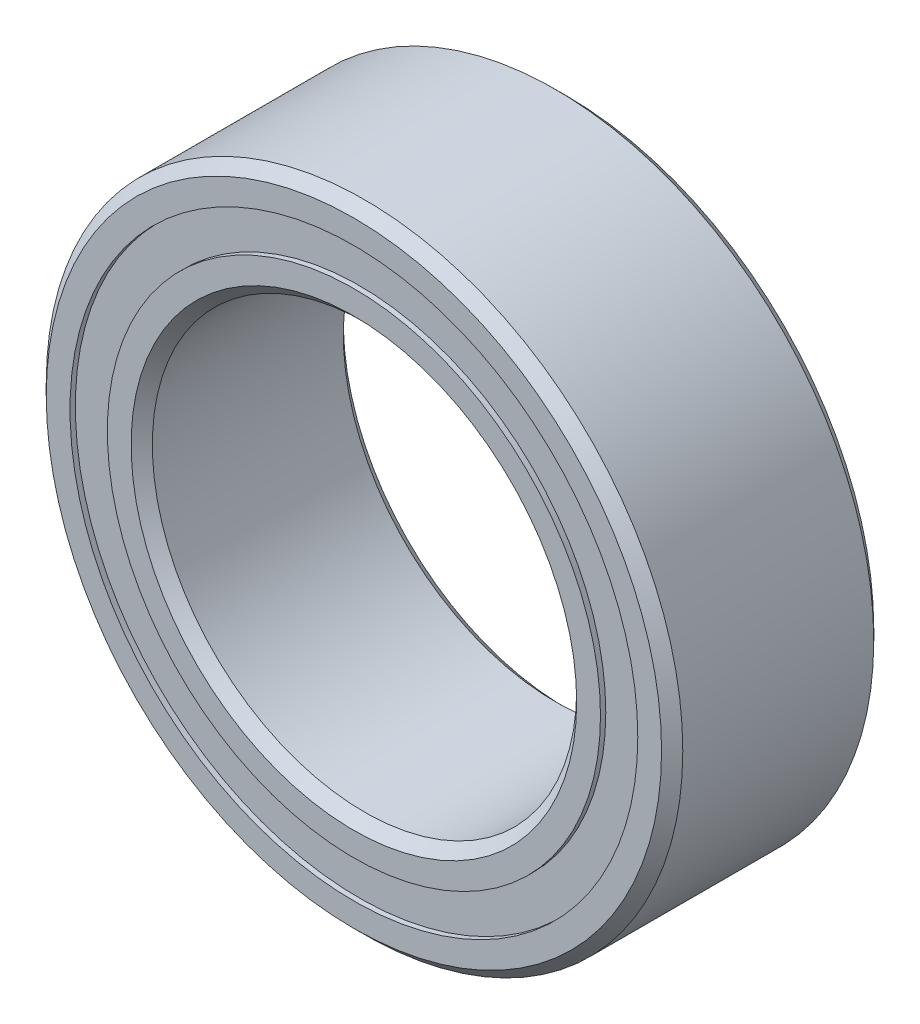
ISO-10303-21;
HEADER;
FILE_DESCRIPTION(('STEP AP214'),'2;1');
FILE_NAME('part.step','',(''),(''),'','','');
FILE_SCHEMA(('AUTOMOTIVE_DESIGN { 1 0 10303 214 1 1 1 1 }'));
ENDSEC;
DATA;
#1=APPLICATION_CONTEXT('core data for automotive mechanical design processes');
#2=APPLICATION_PROTOCOL_DEFINITION('international standard','automotive_design',2000,#1);
#3=PRODUCT_CONTEXT('',#1,'mechanical');
#4=PRODUCT('Part','Part','',(#3));
#5=PRODUCT_RELATED_PRODUCT_CATEGORY('part','',(#4));
#6=PRODUCT_DEFINITION_FORMATION('','',#4);
#7=PRODUCT_DEFINITION_CONTEXT('part definition',#1,'design');
#8=PRODUCT_DEFINITION('design','',#6,#7);
#9=PRODUCT_DEFINITION_SHAPE('','',#8);
#10=(LENGTH_UNIT() NAMED_UNIT(*) SI_UNIT(.MILLI.,.METRE.));
#11=(NAMED_UNIT(*) PLANE_ANGLE_UNIT() SI_UNIT($,.RADIAN.));
#12=(NAMED_UNIT(*) SI_UNIT($,.STERADIAN.) SOLID_ANGLE_UNIT());
#13=UNCERTAINTY_MEASURE_WITH_UNIT(LENGTH_MEASURE(1.E-05),#10,'distance_accuracy_value','');
#14=(GEOMETRIC_REPRESENTATION_CONTEXT(3) GLOBAL_UNCERTAINTY_ASSIGNED_CONTEXT((#13)) GLOBAL_UNIT_ASSIGNED_CONTEXT((#10,
#11,#12)) REPRESENTATION_CONTEXT('',''));
#15=CARTESIAN_POINT('',(0.,0.,0.));
#16=DIRECTION('',(0.,0.,1.));
#17=DIRECTION('',(1.,0.,0.));
#18=AXIS2_PLACEMENT_3D('',#15,#16,#17);
#19=CARTESIAN_POINT('',(3.43703832126948,-1.98437500000002,0.));
#20=DIRECTION('',(0.866025403784437,-0.500000000000004,0.));
#21=DIRECTION('',(0.,0.,-1.));
#22=AXIS2_PLACEMENT_3D('',#19,#20,#21);
#23=SPHERICAL_SURFACE('',#22,0.758760243513404);
#24=CARTESIAN_POINT('',(4.09414396753376,-2.36375512175672,0.));
#25=VERTEX_POINT('',#24);
#26=VERTEX_LOOP('',#25);
#27=FACE_BOUND('',#26,.T.);
#28=CARTESIAN_POINT('',(2.77993267500521,-1.60499487824331,0.));
#29=VERTEX_POINT('',#28);
#30=VERTEX_LOOP('',#29);
#31=FACE_BOUND('',#30,.T.);
#32=ADVANCED_FACE('P0_F16',(#27,#31),#23,.T.);
#33=CLOSED_SHELL('',(#32));
#34=MANIFOLD_SOLID_BREP('P0_B1',#33);
#35=CARTESIAN_POINT('',(3.96875,0.,0.));
#36=DIRECTION('',(1.,0.,0.));
#37=DIRECTION('',(0.,0.,-1.));
#38=AXIS2_PLACEMENT_3D('',#35,#36,#37);
#39=SPHERICAL_SURFACE('',#38,0.758760243513404);
#40=CARTESIAN_POINT('',(3.2099897564866,0.,0.));
#41=VERTEX_POINT('',#40);
#42=VERTEX_LOOP('',#41);
#43=FACE_BOUND('',#42,.T.);
#44=CARTESIAN_POINT('',(4.7275102435134,0.,0.));
#45=VERTEX_POINT('',#44);
#46=VERTEX_LOOP('',#45);
#47=FACE_BOUND('',#46,.T.);
#48=ADVANCED_FACE('P1_F16',(#43,#47),#39,.T.);
#49=CLOSED_SHELL('',(#48));
#50=MANIFOLD_SOLID_BREP('P1_B1',#49);
#51=CARTESIAN_POINT('',(-1.98437500000003,-3.43703832126947,0.));
#52=DIRECTION('',(-0.500000000000007,-0.866025403784435,0.));
#53=DIRECTION('',(0.,0.,-1.));
#54=AXIS2_PLACEMENT_3D('',#51,#52,#53);
#55=SPHERICAL_SURFACE('',#54,0.758760243513404);
#56=CARTESIAN_POINT('',(-2.36375512175674,-4.09414396753375,0.));
#57=VERTEX_POINT('',#56);
#58=VERTEX_LOOP('',#57);
#59=FACE_BOUND('',#58,.T.);
#60=CARTESIAN_POINT('',(-1.60499487824332,-2.7799326750052,0.));
#61=VERTEX_POINT('',#60);
#62=VERTEX_LOOP('',#61);
#63=FACE_BOUND('',#62,.T.);
#64=ADVANCED_FACE('P2_F16',(#59,#63),#55,.T.);
#65=CLOSED_SHELL('',(#64));
#66=MANIFOLD_SOLID_BREP('P2_B1',#65);
#67=CARTESIAN_POINT('',(-3.43703832126947,1.98437500000004,0.));
#68=DIRECTION('',(-0.866025403784433,0.50000000000001,0.));
#69=DIRECTION('',(0.,0.,-1.));
#70=AXIS2_PLACEMENT_3D('',#67,#68,#69);
#71=SPHERICAL_SURFACE('',#70,0.758760243513404);
#72=CARTESIAN_POINT('',(-4.09414396753374,2.36375512175675,0.));
#73=VERTEX_POINT('',#72);
#74=VERTEX_LOOP('',#73);
#75=FACE_BOUND('',#74,.T.);
#76=CARTESIAN_POINT('',(-2.7799326750052,1.60499487824333,0.));
#77=VERTEX_POINT('',#76);
#78=VERTEX_LOOP('',#77);
#79=FACE_BOUND('',#78,.T.);
#80=ADVANCED_FACE('P3_F16',(#75,#79),#71,.T.);
#81=CLOSED_SHELL('',(#80));
#82=MANIFOLD_SOLID_BREP('P3_B1',#81);
#83=CARTESIAN_POINT('',(-3.43703832126951,-1.98437499999997,0.));
#84=DIRECTION('',(-0.866025403784443,-0.499999999999992,0.));
#85=DIRECTION('',(0.,0.,-1.));
#86=AXIS2_PLACEMENT_3D('',#83,#84,#85);
#87=SPHERICAL_SURFACE('',#86,0.758760243513404);
#88=CARTESIAN_POINT('',(-4.09414396753379,-2.36375512175666,0.));
#89=VERTEX_POINT('',#88);
#90=VERTEX_LOOP('',#89);
#91=FACE_BOUND('',#90,.T.);
#92=CARTESIAN_POINT('',(-2.77993267500523,-1.60499487824327,0.));
#93=VERTEX_POINT('',#92);
#94=VERTEX_LOOP('',#93);
#95=FACE_BOUND('',#94,.T.);
#96=ADVANCED_FACE('P4_F16',(#91,#95),#87,.T.);
#97=CLOSED_SHELL('',(#96));
#98=MANIFOLD_SOLID_BREP('P4_B1',#97);
#99=CARTESIAN_POINT('',(1.984375,3.43703832126949,0.));
#100=DIRECTION('',(0.500000000000001,0.866025403784438,0.));
#101=DIRECTION('',(0.,0.,-1.));
#102=AXIS2_PLACEMENT_3D('',#99,#100,#101);
#103=SPHERICAL_SURFACE('',#102,0.758760243513404);
#104=CARTESIAN_POINT('',(2.36375512175671,4.09414396753376,0.));
#105=VERTEX_POINT('',#104);
#106=VERTEX_LOOP('',#105);
#107=FACE_BOUND('',#106,.T.);
#108=CARTESIAN_POINT('',(1.6049948782433,2.77993267500521,0.));
#109=VERTEX_POINT('',#108);
#110=VERTEX_LOOP('',#109);
#111=FACE_BOUND('',#110,.T.);
#112=ADVANCED_FACE('P5_F16',(#107,#111),#103,.T.);
#113=CLOSED_SHELL('',(#112));
#114=MANIFOLD_SOLID_BREP('P5_B1',#113);
#115=CARTESIAN_POINT('',(0.,3.96875,0.));
#116=DIRECTION('',(0.,1.,0.));
#117=DIRECTION('',(0.,0.,-1.));
#118=AXIS2_PLACEMENT_3D('',#115,#116,#117);
#119=SPHERICAL_SURFACE('',#118,0.758760243513404);
#120=CARTESIAN_POINT('',(0.,3.2099897564866,0.));
#121=VERTEX_POINT('',#120);
#122=VERTEX_LOOP('',#121);
#123=FACE_BOUND('',#122,.T.);
#124=CARTESIAN_POINT('',(0.,4.7275102435134,0.));
#125=VERTEX_POINT('',#124);
#126=VERTEX_LOOP('',#125);
#127=FACE_BOUND('',#126,.T.);
#128=ADVANCED_FACE('P6_F16',(#123,#127),#119,.T.);
#129=CLOSED_SHELL('',(#128));
#130=MANIFOLD_SOLID_BREP('P6_B1',#129);
#131=CARTESIAN_POINT('',(0.,-3.96875,0.));
#132=DIRECTION('',(0.,-1.,0.));
#133=DIRECTION('',(0.,0.,-1.));
#134=AXIS2_PLACEMENT_3D('',#131,#132,#133);
#135=SPHERICAL_SURFACE('',#134,0.758760243513404);
#136=CARTESIAN_POINT('',(0.,-3.2099897564866,0.));
#137=VERTEX_POINT('',#136);
#138=VERTEX_LOOP('',#137);
#139=FACE_BOUND('',#138,.T.);
#140=CARTESIAN_POINT('',(0.,-4.7275102435134,0.));
#141=VERTEX_POINT('',#140);
#142=VERTEX_LOOP('',#141);
#143=FACE_BOUND('',#142,.T.);
#144=ADVANCED_FACE('P7_F16',(#139,#143),#135,.T.);
#145=CLOSED_SHELL('',(#144));
#146=MANIFOLD_SOLID_BREP('P7_B1',#145);
#147=CARTESIAN_POINT('',(3.4370383212695,1.98437499999999,0.));
#148=DIRECTION('',(0.86602540378444,0.499999999999998,0.));
#149=DIRECTION('',(0.,0.,-1.));
#150=AXIS2_PLACEMENT_3D('',#147,#148,#149);
#151=SPHERICAL_SURFACE('',#150,0.758760243513404);
#152=CARTESIAN_POINT('',(4.09414396753377,2.36375512175669,0.));
#153=VERTEX_POINT('',#152);
#154=VERTEX_LOOP('',#153);
#155=FACE_BOUND('',#154,.T.);
#156=CARTESIAN_POINT('',(2.77993267500522,1.60499487824329,0.));
#157=VERTEX_POINT('',#156);
#158=VERTEX_LOOP('',#157);
#159=FACE_BOUND('',#158,.T.);
#160=ADVANCED_FACE('P8_F16',(#155,#159),#151,.T.);
#161=CLOSED_SHELL('',(#160));
#162=MANIFOLD_SOLID_BREP('P8_B1',#161);
#163=CARTESIAN_POINT('',(0.,0.,0.));
#164=DIRECTION('',(0.,0.,1.));
#165=DIRECTION('',(1.,0.,0.));
#166=AXIS2_PLACEMENT_3D('',#163,#164,#165);
#167=TOROIDAL_SURFACE('',#166,3.96875,0.758760243513403);
#168=CARTESIAN_POINT('',(0.,0.,0.705555555555556));
#169=DIRECTION('',(0.,0.,1.));
#170=DIRECTION('',(1.,0.,0.));
#171=AXIS2_PLACEMENT_3D('',#168,#169,#170);
#172=CIRCLE('',#171,3.68962912087912);
#173=CARTESIAN_POINT('',(3.68962912087912,0.,0.705555555555556));
#174=VERTEX_POINT('',#173);
#175=EDGE_CURVE('P9_E33',#174,#174,#172,.T.);
#176=ORIENTED_EDGE('',*,*,#175,.F.);
#177=EDGE_LOOP('',(#176));
#178=FACE_BOUND('',#177,.T.);
#179=CARTESIAN_POINT('',(0.,0.,-0.705555555555556));
#180=DIRECTION('',(0.,0.,1.));
#181=DIRECTION('',(1.,0.,0.));
#182=AXIS2_PLACEMENT_3D('',#179,#180,#181);
#183=CIRCLE('',#182,3.68962912087912);
#184=CARTESIAN_POINT('',(3.68962912087912,0.,-0.705555555555556));
#185=VERTEX_POINT('',#184);
#186=EDGE_CURVE('P9_E31',#185,#185,#183,.F.);
#187=ORIENTED_EDGE('',*,*,#186,.F.);
#188=EDGE_LOOP('',(#187));
#189=FACE_BOUND('',#188,.T.);
#190=ADVANCED_FACE('P9_F15',(#178,#189),#167,.F.);
#191=CARTESIAN_POINT('',(0.,0.,1.5875));
#192=DIRECTION('',(0.,0.,1.));
#193=DIRECTION('',(1.,0.,0.));
#194=AXIS2_PLACEMENT_3D('',#191,#192,#193);
#195=CYLINDRICAL_SURFACE('',#194,3.68962912087912);
#196=CARTESIAN_POINT('',(0.,0.,1.5875));
#197=DIRECTION('',(0.,0.,1.));
#198=DIRECTION('',(1.,0.,0.));
#199=AXIS2_PLACEMENT_3D('',#196,#197,#198);
#200=CIRCLE('',#199,3.68962912087912);
#201=CARTESIAN_POINT('',(3.68962912087912,0.,1.5875));
#202=VERTEX_POINT('',#201);
#203=EDGE_CURVE('P9_E19',#202,#202,#200,.F.);
#204=ORIENTED_EDGE('',*,*,#203,.T.);
#205=EDGE_LOOP('',(#204));
#206=FACE_BOUND('',#205,.T.);
#207=ORIENTED_EDGE('',*,*,#175,.T.);
#208=EDGE_LOOP('',(#207));
#209=FACE_BOUND('',#208,.T.);
#210=ADVANCED_FACE('P9_F49',(#206,#209),#195,.T.);
#211=CARTESIAN_POINT('',(0.,0.,1.5875));
#212=DIRECTION('',(0.,0.,1.));
#213=DIRECTION('',(1.,0.,0.));
#214=AXIS2_PLACEMENT_3D('',#211,#212,#213);
#215=CYLINDRICAL_SURFACE('',#214,3.68962912087912);
#216=ORIENTED_EDGE('',*,*,#186,.T.);
#217=EDGE_LOOP('',(#216));
#218=FACE_BOUND('',#217,.T.);
#219=CARTESIAN_POINT('',(0.,0.,-1.5875));
#220=DIRECTION('',(0.,0.,1.));
#221=DIRECTION('',(1.,0.,0.));
#222=AXIS2_PLACEMENT_3D('',#219,#220,#221);
#223=CIRCLE('',#222,3.68962912087912);
#224=CARTESIAN_POINT('',(3.68962912087912,0.,-1.5875));
#225=VERTEX_POINT('',#224);
#226=EDGE_CURVE('P9_E42',#225,#225,#223,.T.);
#227=ORIENTED_EDGE('',*,*,#226,.T.);
#228=EDGE_LOOP('',(#227));
#229=FACE_BOUND('',#228,.T.);
#230=ADVANCED_FACE('P9_F56',(#218,#229),#215,.T.);
#231=CARTESIAN_POINT('',(0.,3.68962912087912,1.5875));
#232=DIRECTION('',(0.,0.,-1.));
#233=DIRECTION('',(-1.,0.,0.));
#234=AXIS2_PLACEMENT_3D('',#231,#232,#233);
#235=PLANE('',#234);
#236=ORIENTED_EDGE('',*,*,#203,.F.);
#237=EDGE_LOOP('',(#236));
#238=FACE_BOUND('',#237,.T.);
#239=CARTESIAN_POINT('',(0.,0.,1.58749999997099));
#240=DIRECTION('',(0.,0.,1.));
#241=DIRECTION('',(1.,0.,0.));
#242=AXIS2_PLACEMENT_3D('',#239,#240,#241);
#243=CIRCLE('',#242,3.33374999996749);
#244=CARTESIAN_POINT('',(3.33374999996749,0.,1.58749999997099));
#245=VERTEX_POINT('',#244);
#246=EDGE_CURVE('P9_E40',#245,#245,#243,.F.);
#247=ORIENTED_EDGE('',*,*,#246,.T.);
#248=EDGE_LOOP('',(#247));
#249=FACE_BOUND('',#248,.T.);
#250=ADVANCED_FACE('P9_F52',(#238,#249),#235,.F.);
#251=CARTESIAN_POINT('',(0.,3.33375,-1.5875));
#252=DIRECTION('',(0.,0.,1.));
#253=DIRECTION('',(1.,0.,0.));
#254=AXIS2_PLACEMENT_3D('',#251,#252,#253);
#255=PLANE('',#254);
#256=CARTESIAN_POINT('',(0.,0.,-1.58749999997099));
#257=DIRECTION('',(0.,0.,-1.));
#258=DIRECTION('',(0.,1.,0.));
#259=AXIS2_PLACEMENT_3D('',#256,#257,#258);
#260=CIRCLE('',#259,3.33375000002434);
#261=CARTESIAN_POINT('',(0.,3.33375000002434,-1.58749999997099));
#262=VERTEX_POINT('',#261);
#263=EDGE_CURVE('P9_E28',#262,#262,#260,.F.);
#264=ORIENTED_EDGE('',*,*,#263,.T.);
#265=EDGE_LOOP('',(#264));
#266=FACE_BOUND('',#265,.T.);
#267=ORIENTED_EDGE('',*,*,#226,.F.);
#268=EDGE_LOOP('',(#267));
#269=FACE_BOUND('',#268,.T.);
#270=ADVANCED_FACE('P9_F55',(#266,#269),#255,.F.);
#271=CARTESIAN_POINT('',(0.,0.,1.58749999991414));
#272=DIRECTION('',(0.,0.,1.));
#273=DIRECTION('',(1.,0.,0.));
#274=AXIS2_PLACEMENT_3D('',#271,#272,#273);
#275=CONICAL_SURFACE('',#274,3.33374999991065,0.785398163397448);
#276=ORIENTED_EDGE('',*,*,#246,.F.);
#277=EDGE_LOOP('',(#276));
#278=FACE_BOUND('',#277,.T.);
#279=CARTESIAN_POINT('',(0.,0.,1.42875));
#280=DIRECTION('',(0.,0.,1.));
#281=DIRECTION('',(1.,0.,0.));
#282=AXIS2_PLACEMENT_3D('',#279,#280,#281);
#283=CIRCLE('',#282,3.175);
#284=CARTESIAN_POINT('',(3.175,0.,1.42875));
#285=VERTEX_POINT('',#284);
#286=EDGE_CURVE('P9_E23',#285,#285,#283,.F.);
#287=ORIENTED_EDGE('',*,*,#286,.T.);
#288=EDGE_LOOP('',(#287));
#289=FACE_BOUND('',#288,.T.);
#290=ADVANCED_FACE('P9_F60',(#278,#289),#275,.F.);
#291=CARTESIAN_POINT('',(0.,0.,-1.58749999997099));
#292=DIRECTION('',(0.,0.,-1.));
#293=DIRECTION('',(0.,1.,0.));
#294=AXIS2_PLACEMENT_3D('',#291,#292,#293);
#295=CONICAL_SURFACE('',#294,3.33375000002434,0.785398163397448);
#296=CARTESIAN_POINT('',(0.,0.,-1.42875));
#297=DIRECTION('',(0.,0.,1.));
#298=DIRECTION('',(1.,0.,0.));
#299=AXIS2_PLACEMENT_3D('',#296,#297,#298);
#300=CIRCLE('',#299,3.175);
#301=CARTESIAN_POINT('',(3.175,0.,-1.42875));
#302=VERTEX_POINT('',#301);
#303=EDGE_CURVE('P9_E10',#302,#302,#300,.T.);
#304=ORIENTED_EDGE('',*,*,#303,.T.);
#305=EDGE_LOOP('',(#304));
#306=FACE_BOUND('',#305,.T.);
#307=ORIENTED_EDGE('',*,*,#263,.F.);
#308=EDGE_LOOP('',(#307));
#309=FACE_BOUND('',#308,.T.);
#310=ADVANCED_FACE('P9_F63',(#306,#309),#295,.F.);
#311=CARTESIAN_POINT('',(0.,0.,1.5875));
#312=DIRECTION('',(0.,0.,1.));
#313=DIRECTION('',(1.,0.,0.));
#314=AXIS2_PLACEMENT_3D('',#311,#312,#313);
#315=CYLINDRICAL_SURFACE('',#314,3.175);
#316=ORIENTED_EDGE('',*,*,#286,.F.);
#317=EDGE_LOOP('',(#316));
#318=FACE_BOUND('',#317,.T.);
#319=ORIENTED_EDGE('',*,*,#303,.F.);
#320=EDGE_LOOP('',(#319));
#321=FACE_BOUND('',#320,.T.);
#322=ADVANCED_FACE('P9_F67',(#318,#321),#315,.F.);
#323=CLOSED_SHELL('',(#190,#210,#230,#250,#270,#290,#310,#322));
#324=MANIFOLD_SOLID_BREP('P9_B1',#323);
#325=CARTESIAN_POINT('',(-3.96875,0.,0.));
#326=DIRECTION('',(-1.,0.,0.));
#327=DIRECTION('',(0.,0.,-1.));
#328=AXIS2_PLACEMENT_3D('',#325,#326,#327);
#329=SPHERICAL_SURFACE('',#328,0.758760243513404);
#330=CARTESIAN_POINT('',(-4.7275102435134,0.,0.));
#331=VERTEX_POINT('',#330);
#332=VERTEX_LOOP('',#331);
#333=FACE_BOUND('',#332,.T.);
#334=CARTESIAN_POINT('',(-3.2099897564866,0.,0.));
#335=VERTEX_POINT('',#334);
#336=VERTEX_LOOP('',#335);
#337=FACE_BOUND('',#336,.T.);
#338=ADVANCED_FACE('P10_F16',(#333,#337),#329,.T.);
#339=CLOSED_SHELL('',(#338));
#340=MANIFOLD_SOLID_BREP('P10_B1',#339);
#341=CARTESIAN_POINT('',(1.98437499999998,-3.4370383212695,0.));
#342=DIRECTION('',(0.499999999999995,-0.866025403784442,0.));
#343=DIRECTION('',(0.,0.,-1.));
#344=AXIS2_PLACEMENT_3D('',#341,#342,#343);
#345=SPHERICAL_SURFACE('',#344,0.758760243513404);
#346=CARTESIAN_POINT('',(1.60499487824328,-2.77993267500523,0.));
#347=VERTEX_POINT('',#346);
#348=VERTEX_LOOP('',#347);
#349=FACE_BOUND('',#348,.T.);
#350=CARTESIAN_POINT('',(2.36375512175668,-4.09414396753378,0.));
#351=VERTEX_POINT('',#350);
#352=VERTEX_LOOP('',#351);
#353=FACE_BOUND('',#352,.T.);
#354=ADVANCED_FACE('P11_F16',(#349,#353),#345,.T.);
#355=CLOSED_SHELL('',(#354));
#356=MANIFOLD_SOLID_BREP('P11_B1',#355);
#357=CARTESIAN_POINT('',(0.,4.24787087912088,0.758760243513404));
#358=DIRECTION('',(0.,0.,1.));
#359=DIRECTION('',(1.,0.,0.));
#360=AXIS2_PLACEMENT_3D('',#357,#358,#359);
#361=PLANE('',#360);
#362=CARTESIAN_POINT('',(0.,0.,0.758760243513404));
#363=DIRECTION('',(0.,0.,1.));
#364=DIRECTION('',(1.,0.,0.));
#365=AXIS2_PLACEMENT_3D('',#362,#363,#364);
#366=CIRCLE('',#365,3.68962912087912);
#367=CARTESIAN_POINT('',(3.68962912087912,0.,0.758760243513404));
#368=VERTEX_POINT('',#367);
#369=EDGE_CURVE('P12_E18',#368,#368,#366,.T.);
#370=ORIENTED_EDGE('',*,*,#369,.T.);
#371=EDGE_LOOP('',(#370));
#372=FACE_BOUND('',#371,.T.);
#373=CARTESIAN_POINT('',(0.,0.,0.758760243513404));
#374=DIRECTION('',(0.,0.,1.));
#375=DIRECTION('',(1.,0.,0.));
#376=AXIS2_PLACEMENT_3D('',#373,#374,#375);
#377=CIRCLE('',#376,4.24787087912088);
#378=CARTESIAN_POINT('',(4.24787087912088,0.,0.758760243513404));
#379=VERTEX_POINT('',#378);
#380=EDGE_CURVE('P12_E27',#379,#379,#377,.T.);
#381=ORIENTED_EDGE('',*,*,#380,.F.);
#382=EDGE_LOOP('',(#381));
#383=FACE_BOUND('',#382,.T.);
#384=ADVANCED_FACE('P12_F15',(#372,#383),#361,.F.);
#385=CARTESIAN_POINT('',(0.,0.,1.5875));
#386=DIRECTION('',(0.,0.,1.));
#387=DIRECTION('',(1.,0.,0.));
#388=AXIS2_PLACEMENT_3D('',#385,#386,#387);
#389=CYLINDRICAL_SURFACE('',#388,3.68962912087912);
#390=ORIENTED_EDGE('',*,*,#369,.F.);
#391=EDGE_LOOP('',(#390));
#392=FACE_BOUND('',#391,.T.);
#393=CARTESIAN_POINT('',(0.,0.,1.508125));
#394=DIRECTION('',(0.,0.,1.));
#395=DIRECTION('',(1.,0.,0.));
#396=AXIS2_PLACEMENT_3D('',#393,#394,#395);
#397=CIRCLE('',#396,3.68962912087912);
#398=CARTESIAN_POINT('',(3.68962912087912,0.,1.508125));
#399=VERTEX_POINT('',#398);
#400=EDGE_CURVE('P12_E22',#399,#399,#397,.T.);
#401=ORIENTED_EDGE('',*,*,#400,.T.);
#402=EDGE_LOOP('',(#401));
#403=FACE_BOUND('',#402,.T.);
#404=ADVANCED_FACE('P12_F37',(#392,#403),#389,.F.);
#405=CARTESIAN_POINT('',(0.,0.,1.5875));
#406=DIRECTION('',(0.,0.,1.));
#407=DIRECTION('',(1.,0.,0.));
#408=AXIS2_PLACEMENT_3D('',#405,#406,#407);
#409=CYLINDRICAL_SURFACE('',#408,4.24787087912088);
#410=CARTESIAN_POINT('',(0.,0.,1.508125));
#411=DIRECTION('',(0.,0.,1.));
#412=DIRECTION('',(1.,0.,0.));
#413=AXIS2_PLACEMENT_3D('',#410,#411,#412);
#414=CIRCLE('',#413,4.24787087912088);
#415=CARTESIAN_POINT('',(4.24787087912088,0.,1.508125));
#416=VERTEX_POINT('',#415);
#417=EDGE_CURVE('P12_E10',#416,#416,#414,.F.);
#418=ORIENTED_EDGE('',*,*,#417,.T.);
#419=EDGE_LOOP('',(#418));
#420=FACE_BOUND('',#419,.T.);
#421=ORIENTED_EDGE('',*,*,#380,.T.);
#422=EDGE_LOOP('',(#421));
#423=FACE_BOUND('',#422,.T.);
#424=ADVANCED_FACE('P12_F40',(#420,#423),#409,.T.);
#425=CARTESIAN_POINT('',(0.,4.24787087912088,1.508125));
#426=DIRECTION('',(0.,0.,-1.));
#427=DIRECTION('',(-1.,0.,0.));
#428=AXIS2_PLACEMENT_3D('',#425,#426,#427);
#429=PLANE('',#428);
#430=ORIENTED_EDGE('',*,*,#417,.F.);
#431=EDGE_LOOP('',(#430));
#432=FACE_BOUND('',#431,.T.);
#433=ORIENTED_EDGE('',*,*,#400,.F.);
#434=EDGE_LOOP('',(#433));
#435=FACE_BOUND('',#434,.T.);
#436=ADVANCED_FACE('P12_F43',(#432,#435),#429,.F.);
#437=CLOSED_SHELL('',(#384,#404,#424,#436));
#438=MANIFOLD_SOLID_BREP('P12_B1',#437);
#439=CARTESIAN_POINT('',(0.,4.24787087912088,-1.508125));
#440=DIRECTION('',(0.,0.,1.));
#441=DIRECTION('',(1.,0.,0.));
#442=AXIS2_PLACEMENT_3D('',#439,#440,#441);
#443=PLANE('',#442);
#444=CARTESIAN_POINT('',(0.,0.,-1.508125));
#445=DIRECTION('',(0.,0.,1.));
#446=DIRECTION('',(1.,0.,0.));
#447=AXIS2_PLACEMENT_3D('',#444,#445,#446);
#448=CIRCLE('',#447,3.68962912087912);
#449=CARTESIAN_POINT('',(3.68962912087912,0.,-1.508125));
#450=VERTEX_POINT('',#449);
#451=EDGE_CURVE('P13_E18',#450,#450,#448,.T.);
#452=ORIENTED_EDGE('',*,*,#451,.T.);
#453=EDGE_LOOP('',(#452));
#454=FACE_BOUND('',#453,.T.);
#455=CARTESIAN_POINT('',(0.,0.,-1.508125));
#456=DIRECTION('',(0.,0.,1.));
#457=DIRECTION('',(1.,0.,0.));
#458=AXIS2_PLACEMENT_3D('',#455,#456,#457);
#459=CIRCLE('',#458,4.24787087912088);
#460=CARTESIAN_POINT('',(4.24787087912088,0.,-1.508125));
#461=VERTEX_POINT('',#460);
#462=EDGE_CURVE('P13_E27',#461,#461,#459,.T.);
#463=ORIENTED_EDGE('',*,*,#462,.F.);
#464=EDGE_LOOP('',(#463));
#465=FACE_BOUND('',#464,.T.);
#466=ADVANCED_FACE('P13_F15',(#454,#465),#443,.F.);
#467=CARTESIAN_POINT('',(0.,0.,1.5875));
#468=DIRECTION('',(0.,0.,1.));
#469=DIRECTION('',(1.,0.,0.));
#470=AXIS2_PLACEMENT_3D('',#467,#468,#469);
#471=CYLINDRICAL_SURFACE('',#470,3.68962912087912);
#472=ORIENTED_EDGE('',*,*,#451,.F.);
#473=EDGE_LOOP('',(#472));
#474=FACE_BOUND('',#473,.T.);
#475=CARTESIAN_POINT('',(0.,0.,-0.758760243513405));
#476=DIRECTION('',(0.,0.,1.));
#477=DIRECTION('',(1.,0.,0.));
#478=AXIS2_PLACEMENT_3D('',#475,#476,#477);
#479=CIRCLE('',#478,3.68962912087912);
#480=CARTESIAN_POINT('',(3.68962912087912,0.,-0.758760243513405));
#481=VERTEX_POINT('',#480);
#482=EDGE_CURVE('P13_E22',#481,#481,#479,.T.);
#483=ORIENTED_EDGE('',*,*,#482,.T.);
#484=EDGE_LOOP('',(#483));
#485=FACE_BOUND('',#484,.T.);
#486=ADVANCED_FACE('P13_F37',(#474,#485),#471,.F.);
#487=CARTESIAN_POINT('',(0.,0.,1.5875));
#488=DIRECTION('',(0.,0.,1.));
#489=DIRECTION('',(1.,0.,0.));
#490=AXIS2_PLACEMENT_3D('',#487,#488,#489);
#491=CYLINDRICAL_SURFACE('',#490,4.24787087912088);
#492=CARTESIAN_POINT('',(0.,0.,-0.758760243513404));
#493=DIRECTION('',(0.,0.,1.));
#494=DIRECTION('',(1.,0.,0.));
#495=AXIS2_PLACEMENT_3D('',#492,#493,#494);
#496=CIRCLE('',#495,4.24787087912088);
#497=CARTESIAN_POINT('',(4.24787087912088,0.,-0.758760243513404));
#498=VERTEX_POINT('',#497);
#499=EDGE_CURVE('P13_E10',#498,#498,#496,.F.);
#500=ORIENTED_EDGE('',*,*,#499,.T.);
#501=EDGE_LOOP('',(#500));
#502=FACE_BOUND('',#501,.T.);
#503=ORIENTED_EDGE('',*,*,#462,.T.);
#504=EDGE_LOOP('',(#503));
#505=FACE_BOUND('',#504,.T.);
#506=ADVANCED_FACE('P13_F40',(#502,#505),#491,.T.);
#507=CARTESIAN_POINT('',(0.,4.24787087912088,-0.758760243513404));
#508=DIRECTION('',(0.,0.,-1.));
#509=DIRECTION('',(-1.,0.,0.));
#510=AXIS2_PLACEMENT_3D('',#507,#508,#509);
#511=PLANE('',#510);
#512=ORIENTED_EDGE('',*,*,#499,.F.);
#513=EDGE_LOOP('',(#512));
#514=FACE_BOUND('',#513,.T.);
#515=ORIENTED_EDGE('',*,*,#482,.F.);
#516=EDGE_LOOP('',(#515));
#517=FACE_BOUND('',#516,.T.);
#518=ADVANCED_FACE('P13_F43',(#514,#517),#511,.F.);
#519=CLOSED_SHELL('',(#466,#486,#506,#518));
#520=MANIFOLD_SOLID_BREP('P13_B1',#519);
#521=CARTESIAN_POINT('',(-1.98437499999996,3.43703832126952,0.));
#522=DIRECTION('',(-0.499999999999989,0.866025403784445,0.));
#523=DIRECTION('',(0.,0.,-1.));
#524=AXIS2_PLACEMENT_3D('',#521,#522,#523);
#525=SPHERICAL_SURFACE('',#524,0.758760243513404);
#526=CARTESIAN_POINT('',(-2.36375512175665,4.0941439675338,0.));
#527=VERTEX_POINT('',#526);
#528=VERTEX_LOOP('',#527);
#529=FACE_BOUND('',#528,.T.);
#530=CARTESIAN_POINT('',(-1.60499487824326,2.77993267500524,0.));
#531=VERTEX_POINT('',#530);
#532=VERTEX_LOOP('',#531);
#533=FACE_BOUND('',#532,.T.);
#534=ADVANCED_FACE('P14_F16',(#529,#533),#525,.T.);
#535=CLOSED_SHELL('',(#534));
#536=MANIFOLD_SOLID_BREP('P14_B1',#535);
#537=CARTESIAN_POINT('',(0.,0.,0.));
#538=DIRECTION('',(0.,0.,1.));
#539=DIRECTION('',(1.,0.,0.));
#540=AXIS2_PLACEMENT_3D('',#537,#538,#539);
#541=TOROIDAL_SURFACE('',#540,3.96875,0.758760243513404);
#542=CARTESIAN_POINT('',(0.,0.,-0.705555555555556));
#543=DIRECTION('',(0.,0.,1.));
#544=DIRECTION('',(1.,0.,0.));
#545=AXIS2_PLACEMENT_3D('',#542,#543,#544);
#546=CIRCLE('',#545,4.24787087912088);
#547=CARTESIAN_POINT('',(4.24787087912088,0.,-0.705555555555556));
#548=VERTEX_POINT('',#547);
#549=EDGE_CURVE('P15_E33',#548,#548,#546,.F.);
#550=ORIENTED_EDGE('',*,*,#549,.T.);
#551=EDGE_LOOP('',(#550));
#552=FACE_BOUND('',#551,.T.);
#553=CARTESIAN_POINT('',(0.,0.,0.705555555555555));
#554=DIRECTION('',(0.,0.,1.));
#555=DIRECTION('',(1.,0.,0.));
#556=AXIS2_PLACEMENT_3D('',#553,#554,#555);
#557=CIRCLE('',#556,4.24787087912088);
#558=CARTESIAN_POINT('',(4.24787087912088,0.,0.705555555555555));
#559=VERTEX_POINT('',#558);
#560=EDGE_CURVE('P15_E31',#559,#559,#557,.T.);
#561=ORIENTED_EDGE('',*,*,#560,.T.);
#562=EDGE_LOOP('',(#561));
#563=FACE_BOUND('',#562,.T.);
#564=ADVANCED_FACE('P15_F15',(#552,#563),#541,.F.);
#565=CARTESIAN_POINT('',(0.,0.,1.5875));
#566=DIRECTION('',(0.,0.,1.));
#567=DIRECTION('',(1.,0.,0.));
#568=AXIS2_PLACEMENT_3D('',#565,#566,#567);
#569=CYLINDRICAL_SURFACE('',#568,4.24787087912088);
#570=CARTESIAN_POINT('',(0.,0.,-1.5875));
#571=DIRECTION('',(0.,0.,1.));
#572=DIRECTION('',(1.,0.,0.));
#573=AXIS2_PLACEMENT_3D('',#570,#571,#572);
#574=CIRCLE('',#573,4.24787087912088);
#575=CARTESIAN_POINT('',(4.24787087912088,0.,-1.5875));
#576=VERTEX_POINT('',#575);
#577=EDGE_CURVE('P15_E19',#576,#576,#574,.F.);
#578=ORIENTED_EDGE('',*,*,#577,.T.);
#579=EDGE_LOOP('',(#578));
#580=FACE_BOUND('',#579,.T.);
#581=ORIENTED_EDGE('',*,*,#549,.F.);
#582=EDGE_LOOP('',(#581));
#583=FACE_BOUND('',#582,.T.);
#584=ADVANCED_FACE('P15_F49',(#580,#583),#569,.F.);
#585=CARTESIAN_POINT('',(0.,0.,1.5875));
#586=DIRECTION('',(0.,0.,1.));
#587=DIRECTION('',(1.,0.,0.));
#588=AXIS2_PLACEMENT_3D('',#585,#586,#587);
#589=CYLINDRICAL_SURFACE('',#588,4.24787087912088);
#590=ORIENTED_EDGE('',*,*,#560,.F.);
#591=EDGE_LOOP('',(#590));
#592=FACE_BOUND('',#591,.T.);
#593=CARTESIAN_POINT('',(0.,0.,1.5875));
#594=DIRECTION('',(0.,0.,1.));
#595=DIRECTION('',(1.,0.,0.));
#596=AXIS2_PLACEMENT_3D('',#593,#594,#595);
#597=CIRCLE('',#596,4.24787087912088);
#598=CARTESIAN_POINT('',(4.24787087912088,0.,1.5875));
#599=VERTEX_POINT('',#598);
#600=EDGE_CURVE('P15_E42',#599,#599,#597,.T.);
#601=ORIENTED_EDGE('',*,*,#600,.T.);
#602=EDGE_LOOP('',(#601));
#603=FACE_BOUND('',#602,.T.);
#604=ADVANCED_FACE('P15_F56',(#592,#603),#589,.F.);
#605=CARTESIAN_POINT('',(0.,4.60375,-1.5875));
#606=DIRECTION('',(0.,0.,1.));
#607=DIRECTION('',(1.,0.,0.));
#608=AXIS2_PLACEMENT_3D('',#605,#606,#607);
#609=PLANE('',#608);
#610=ORIENTED_EDGE('',*,*,#577,.F.);
#611=EDGE_LOOP('',(#610));
#612=FACE_BOUND('',#611,.T.);
#613=CARTESIAN_POINT('',(0.,0.,-1.58750000008467));
#614=DIRECTION('',(0.,0.,1.));
#615=DIRECTION('',(1.,0.,0.));
#616=AXIS2_PLACEMENT_3D('',#613,#614,#615);
#617=CIRCLE('',#616,4.60375000000113);
#618=CARTESIAN_POINT('',(4.60375000000113,0.,-1.58750000008467));
#619=VERTEX_POINT('',#618);
#620=EDGE_CURVE('P15_E40',#619,#619,#617,.T.);
#621=ORIENTED_EDGE('',*,*,#620,.F.);
#622=EDGE_LOOP('',(#621));
#623=FACE_BOUND('',#622,.T.);
#624=ADVANCED_FACE('P15_F52',(#612,#623),#609,.F.);
#625=CARTESIAN_POINT('',(0.,4.60375,1.5875));
#626=DIRECTION('',(0.,0.,-1.));
#627=DIRECTION('',(-1.,0.,0.));
#628=AXIS2_PLACEMENT_3D('',#625,#626,#627);
#629=PLANE('',#628);
#630=CARTESIAN_POINT('',(0.,0.,1.58750000008467));
#631=DIRECTION('',(0.,0.,-1.));
#632=DIRECTION('',(-1.,0.,0.));
#633=AXIS2_PLACEMENT_3D('',#630,#631,#632);
#634=CIRCLE('',#633,4.60375000000113);
#635=CARTESIAN_POINT('',(-4.60375000000113,0.,1.58750000008467));
#636=VERTEX_POINT('',#635);
#637=EDGE_CURVE('P15_E28',#636,#636,#634,.T.);
#638=ORIENTED_EDGE('',*,*,#637,.F.);
#639=EDGE_LOOP('',(#638));
#640=FACE_BOUND('',#639,.T.);
#641=ORIENTED_EDGE('',*,*,#600,.F.);
#642=EDGE_LOOP('',(#641));
#643=FACE_BOUND('',#642,.T.);
#644=ADVANCED_FACE('P15_F55',(#640,#643),#629,.F.);
#645=CARTESIAN_POINT('',(0.,0.,-1.42875000000231));
#646=DIRECTION('',(0.,0.,1.));
#647=DIRECTION('',(1.,0.,0.));
#648=AXIS2_PLACEMENT_3D('',#645,#646,#647);
#649=CONICAL_SURFACE('',#648,4.76250000002665,0.785398163218414);
#650=CARTESIAN_POINT('',(0.,0.,-1.42875));
#651=DIRECTION('',(0.,0.,1.));
#652=DIRECTION('',(1.,0.,0.));
#653=AXIS2_PLACEMENT_3D('',#650,#651,#652);
#654=CIRCLE('',#653,4.7625);
#655=CARTESIAN_POINT('',(4.7625,0.,-1.42875));
#656=VERTEX_POINT('',#655);
#657=EDGE_CURVE('P15_E23',#656,#656,#654,.T.);
#658=ORIENTED_EDGE('',*,*,#657,.F.);
#659=EDGE_LOOP('',(#658));
#660=FACE_BOUND('',#659,.T.);
#661=ORIENTED_EDGE('',*,*,#620,.T.);
#662=EDGE_LOOP('',(#661));
#663=FACE_BOUND('',#662,.T.);
#664=ADVANCED_FACE('P15_F60',(#660,#663),#649,.T.);
#665=CARTESIAN_POINT('',(0.,0.,1.42875000005915));
#666=DIRECTION('',(0.,0.,-1.));
#667=DIRECTION('',(-1.,0.,0.));
#668=AXIS2_PLACEMENT_3D('',#665,#666,#667);
#669=CONICAL_SURFACE('',#668,4.7624999999698,0.785398163218414);
#670=CARTESIAN_POINT('',(0.,0.,1.42875));
#671=DIRECTION('',(0.,0.,1.));
#672=DIRECTION('',(1.,0.,0.));
#673=AXIS2_PLACEMENT_3D('',#670,#671,#672);
#674=CIRCLE('',#673,4.7625);
#675=CARTESIAN_POINT('',(4.7625,0.,1.42875));
#676=VERTEX_POINT('',#675);
#677=EDGE_CURVE('P15_E10',#676,#676,#674,.F.);
#678=ORIENTED_EDGE('',*,*,#677,.F.);
#679=EDGE_LOOP('',(#678));
#680=FACE_BOUND('',#679,.T.);
#681=ORIENTED_EDGE('',*,*,#637,.T.);
#682=EDGE_LOOP('',(#681));
#683=FACE_BOUND('',#682,.T.);
#684=ADVANCED_FACE('P15_F62',(#680,#683),#669,.T.);
#685=CARTESIAN_POINT('',(0.,0.,1.5875));
#686=DIRECTION('',(0.,0.,1.));
#687=DIRECTION('',(1.,0.,0.));
#688=AXIS2_PLACEMENT_3D('',#685,#686,#687);
#689=CYLINDRICAL_SURFACE('',#688,4.7625);
#690=ORIENTED_EDGE('',*,*,#677,.T.);
#691=EDGE_LOOP('',(#690));
#692=FACE_BOUND('',#691,.T.);
#693=ORIENTED_EDGE('',*,*,#657,.T.);
#694=EDGE_LOOP('',(#693));
#695=FACE_BOUND('',#694,.T.);
#696=ADVANCED_FACE('P15_F70',(#692,#695),#689,.T.);
#697=CLOSED_SHELL('',(#564,#584,#604,#624,#644,#664,#684,#696));
#698=MANIFOLD_SOLID_BREP('P15_B1',#697);
#699=ADVANCED_BREP_SHAPE_REPRESENTATION('',(#18,#34,#50,#66,#82,#98,#114,#130,#146,#162,#324,
#340,#356,#438,#520,#536,#698),#14);
#700=SHAPE_DEFINITION_REPRESENTATION(#9,#699);
ENDSEC;
END-ISO-10303-21;
